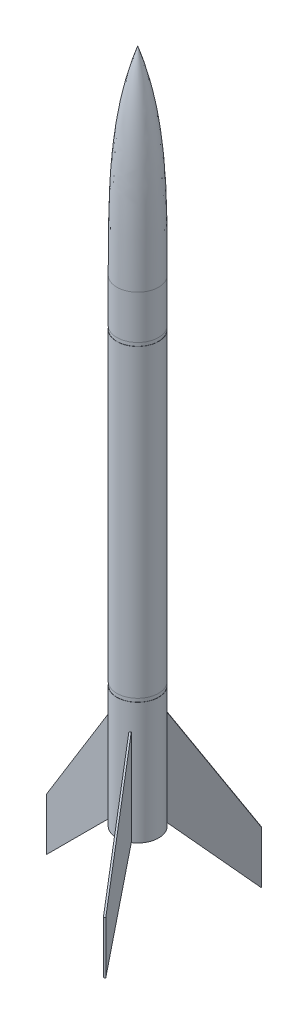
ISO-10303-21;
HEADER;
FILE_DESCRIPTION(('STEP AP214'),'2;1');
FILE_NAME('part.step','',(''),(''),'','','');
FILE_SCHEMA(('AUTOMOTIVE_DESIGN { 1 0 10303 214 1 1 1 1 }'));
ENDSEC;
DATA;
#1=APPLICATION_CONTEXT('core data for automotive mechanical design processes');
#2=APPLICATION_PROTOCOL_DEFINITION('international standard','automotive_design',2000,#1);
#3=PRODUCT_CONTEXT('',#1,'mechanical');
#4=PRODUCT('Part','Part','',(#3));
#5=PRODUCT_RELATED_PRODUCT_CATEGORY('part','',(#4));
#6=PRODUCT_DEFINITION_FORMATION('','',#4);
#7=PRODUCT_DEFINITION_CONTEXT('part definition',#1,'design');
#8=PRODUCT_DEFINITION('design','',#6,#7);
#9=PRODUCT_DEFINITION_SHAPE('','',#8);
#10=(LENGTH_UNIT() NAMED_UNIT(*) SI_UNIT(.MILLI.,.METRE.));
#11=(NAMED_UNIT(*) PLANE_ANGLE_UNIT() SI_UNIT($,.RADIAN.));
#12=(NAMED_UNIT(*) SI_UNIT($,.STERADIAN.) SOLID_ANGLE_UNIT());
#13=UNCERTAINTY_MEASURE_WITH_UNIT(LENGTH_MEASURE(1.E-05),#10,'distance_accuracy_value','');
#14=(GEOMETRIC_REPRESENTATION_CONTEXT(3) GLOBAL_UNCERTAINTY_ASSIGNED_CONTEXT((#13)) GLOBAL_UNIT_ASSIGNED_CONTEXT((#10,
#11,#12)) REPRESENTATION_CONTEXT('',''));
#15=CARTESIAN_POINT('',(0.,0.,0.));
#16=DIRECTION('',(0.,0.,1.));
#17=DIRECTION('',(1.,0.,0.));
#18=AXIS2_PLACEMENT_3D('',#15,#16,#17);
#19=CARTESIAN_POINT('',(0.,0.,0.));
#20=DIRECTION('',(0.,-1.,0.));
#21=DIRECTION('',(0.,0.,-1.));
#22=AXIS2_PLACEMENT_3D('',#19,#20,#21);
#23=CYLINDRICAL_SURFACE('',#22,12.);
#24=DIRECTION('',(0.,-1.,0.));
#25=VECTOR('',#24,1.);
#26=CARTESIAN_POINT('',(6.42780210603302,0.,10.1332798286476));
#27=LINE('',#26,#25);
#28=CARTESIAN_POINT('',(6.42780210603302,0.,10.1332798286476));
#29=VERTEX_POINT('',#28);
#30=CARTESIAN_POINT('',(6.42780210603302,55.,10.1332798286477));
#31=VERTEX_POINT('',#30);
#32=EDGE_CURVE('E11',#29,#31,#27,.F.);
#33=ORIENTED_EDGE('',*,*,#32,.F.);
#34=CARTESIAN_POINT('',(0.,0.,0.));
#35=DIRECTION('',(0.,-1.,0.));
#36=DIRECTION('',(0.,0.,-1.));
#37=AXIS2_PLACEMENT_3D('',#34,#35,#36);
#38=CIRCLE('',#37,12.);
#39=CARTESIAN_POINT('',(6.42780210603317,0.,-10.1332798286476));
#40=VERTEX_POINT('',#39);
#41=EDGE_CURVE('E357',#40,#29,#38,.T.);
#42=ORIENTED_EDGE('',*,*,#41,.F.);
#43=DIRECTION('',(0.,-1.,0.));
#44=VECTOR('',#43,1.);
#45=CARTESIAN_POINT('',(6.42780210603317,0.,-10.1332798286476));
#46=LINE('',#45,#44);
#47=CARTESIAN_POINT('',(6.42780210603317,55.,-10.1332798286476));
#48=VERTEX_POINT('',#47);
#49=EDGE_CURVE('E372',#40,#48,#46,.F.);
#50=ORIENTED_EDGE('',*,*,#49,.T.);
#51=CARTESIAN_POINT('',(0.,55.,0.));
#52=DIRECTION('',(0.,-1.,0.));
#53=DIRECTION('',(0.,0.,-1.));
#54=AXIS2_PLACEMENT_3D('',#51,#52,#53);
#55=CIRCLE('',#54,12.);
#56=CARTESIAN_POINT('',(6.00000000000005,55.,-10.3923048454132));
#57=VERTEX_POINT('',#56);
#58=EDGE_CURVE('E374',#48,#57,#55,.F.);
#59=ORIENTED_EDGE('',*,*,#58,.T.);
#60=CARTESIAN_POINT('',(5.56177670224873,55.,-10.6332798286476));
#61=VERTEX_POINT('',#60);
#62=EDGE_CURVE('E377',#57,#61,#55,.F.);
#63=ORIENTED_EDGE('',*,*,#62,.T.);
#64=DIRECTION('',(0.,-1.,0.));
#65=VECTOR('',#64,1.);
#66=CARTESIAN_POINT('',(5.56177670224873,0.,-10.6332798286476));
#67=LINE('',#66,#65);
#68=CARTESIAN_POINT('',(5.56177670224873,0.,-10.6332798286476));
#69=VERTEX_POINT('',#68);
#70=EDGE_CURVE('E378',#69,#61,#67,.F.);
#71=ORIENTED_EDGE('',*,*,#70,.F.);
#72=CARTESIAN_POINT('',(-11.9895788082818,0.,-0.5));
#73=VERTEX_POINT('',#72);
#74=EDGE_CURVE('E359',#73,#69,#38,.T.);
#75=ORIENTED_EDGE('',*,*,#74,.F.);
#76=DIRECTION('',(0.,-1.,0.));
#77=VECTOR('',#76,1.);
#78=CARTESIAN_POINT('',(-11.9895788082818,0.,-0.5));
#79=LINE('',#78,#77);
#80=CARTESIAN_POINT('',(-11.9895788082818,55.,-0.5));
#81=VERTEX_POINT('',#80);
#82=EDGE_CURVE('E362',#73,#81,#79,.F.);
#83=ORIENTED_EDGE('',*,*,#82,.T.);
#84=CARTESIAN_POINT('',(0.,55.,0.));
#85=DIRECTION('',(0.,-1.,0.));
#86=DIRECTION('',(0.,0.,-1.));
#87=AXIS2_PLACEMENT_3D('',#84,#85,#86);
#88=CIRCLE('',#87,12.);
#89=CARTESIAN_POINT('',(-12.,55.,0.));
#90=VERTEX_POINT('',#89);
#91=EDGE_CURVE('E366',#81,#90,#88,.F.);
#92=ORIENTED_EDGE('',*,*,#91,.T.);
#93=CARTESIAN_POINT('',(-11.9895788082818,55.,0.5));
#94=VERTEX_POINT('',#93);
#95=EDGE_CURVE('E369',#90,#94,#88,.F.);
#96=ORIENTED_EDGE('',*,*,#95,.T.);
#97=DIRECTION('',(0.,-1.,0.));
#98=VECTOR('',#97,1.);
#99=CARTESIAN_POINT('',(-11.9895788082818,0.,0.5));
#100=LINE('',#99,#98);
#101=CARTESIAN_POINT('',(-11.9895788082818,0.,0.5));
#102=VERTEX_POINT('',#101);
#103=EDGE_CURVE('E370',#102,#94,#100,.F.);
#104=ORIENTED_EDGE('',*,*,#103,.F.);
#105=CARTESIAN_POINT('',(5.56177670224858,0.,10.6332798286476));
#106=VERTEX_POINT('',#105);
#107=EDGE_CURVE('E360',#106,#102,#38,.T.);
#108=ORIENTED_EDGE('',*,*,#107,.F.);
#109=DIRECTION('',(0.,-1.,0.));
#110=VECTOR('',#109,1.);
#111=CARTESIAN_POINT('',(5.56177670224858,0.,10.6332798286476));
#112=LINE('',#111,#110);
#113=CARTESIAN_POINT('',(5.56177670224858,55.,10.6332798286476));
#114=VERTEX_POINT('',#113);
#115=EDGE_CURVE('E380',#106,#114,#112,.F.);
#116=ORIENTED_EDGE('',*,*,#115,.T.);
#117=CARTESIAN_POINT('',(0.,55.,0.));
#118=DIRECTION('',(0.,-1.,0.));
#119=DIRECTION('',(0.,0.,-1.));
#120=AXIS2_PLACEMENT_3D('',#117,#118,#119);
#121=CIRCLE('',#120,12.);
#122=CARTESIAN_POINT('',(5.9999999999999,55.,10.3923048454133));
#123=VERTEX_POINT('',#122);
#124=EDGE_CURVE('E382',#114,#123,#121,.F.);
#125=ORIENTED_EDGE('',*,*,#124,.T.);
#126=EDGE_CURVE('E50',#123,#31,#121,.F.);
#127=ORIENTED_EDGE('',*,*,#126,.T.);
#128=EDGE_LOOP('',(#33,#42,#50,#59,#63,#71,#75,#83,#92,#96,#104,#108,#116,#125,#127));
#129=FACE_BOUND('',#128,.T.);
#130=CARTESIAN_POINT('',(0.,70.,0.));
#131=DIRECTION('',(0.,1.,0.));
#132=DIRECTION('',(0.,0.,1.));
#133=AXIS2_PLACEMENT_3D('',#130,#131,#132);
#134=CIRCLE('',#133,12.);
#135=CARTESIAN_POINT('',(0.,70.,12.));
#136=VERTEX_POINT('',#135);
#137=EDGE_CURVE('E214',#136,#136,#134,.T.);
#138=ORIENTED_EDGE('',*,*,#137,.F.);
#139=EDGE_LOOP('',(#138));
#140=FACE_BOUND('',#139,.T.);
#141=ADVANCED_FACE('F42',(#129,#140),#23,.T.);
#142=CARTESIAN_POINT('',(12.,0.,0.));
#143=DIRECTION('',(0.,-1.,0.));
#144=DIRECTION('',(0.,0.,-1.));
#145=AXIS2_PLACEMENT_3D('',#142,#143,#144);
#146=PLANE('',#145);
#147=ORIENTED_EDGE('',*,*,#41,.T.);
#148=DIRECTION('',(-0.499999999999992,0.,-0.866025403784443));
#149=VECTOR('',#148,1.);
#150=CARTESIAN_POINT('',(6.43301270189213,0.,10.1423048454133));
#151=LINE('',#150,#149);
#152=CARTESIAN_POINT('',(6.43301270189213,0.,10.1423048454133));
#153=VERTEX_POINT('',#152);
#154=EDGE_CURVE('E188',#153,#29,#151,.T.);
#155=ORIENTED_EDGE('',*,*,#154,.F.);
#156=DIRECTION('',(-0.866025403784443,0.,0.499999999999992));
#157=VECTOR('',#156,1.);
#158=CARTESIAN_POINT('',(6.43301270189213,0.,10.1423048454133));
#159=LINE('',#158,#157);
#160=CARTESIAN_POINT('',(5.56698729810768,0.,10.6423048454133));
#161=VERTEX_POINT('',#160);
#162=EDGE_CURVE('E210',#153,#161,#159,.T.);
#163=ORIENTED_EDGE('',*,*,#162,.T.);
#164=DIRECTION('',(-0.499999999999992,0.,-0.866025403784443));
#165=VECTOR('',#164,1.);
#166=CARTESIAN_POINT('',(5.56698729810768,0.,10.6423048454133));
#167=LINE('',#166,#165);
#168=EDGE_CURVE('E211',#161,#106,#167,.T.);
#169=ORIENTED_EDGE('',*,*,#168,.T.);
#170=ORIENTED_EDGE('',*,*,#107,.T.);
#171=DIRECTION('',(1.,0.,0.));
#172=VECTOR('',#171,1.);
#173=CARTESIAN_POINT('',(-12.,0.,0.5));
#174=LINE('',#173,#172);
#175=CARTESIAN_POINT('',(-12.,0.,0.5));
#176=VERTEX_POINT('',#175);
#177=EDGE_CURVE('E261',#176,#102,#174,.T.);
#178=ORIENTED_EDGE('',*,*,#177,.F.);
#179=DIRECTION('',(0.,0.,-1.));
#180=VECTOR('',#179,1.);
#181=CARTESIAN_POINT('',(-12.,0.,0.5));
#182=LINE('',#181,#180);
#183=CARTESIAN_POINT('',(-12.,0.,-0.5));
#184=VERTEX_POINT('',#183);
#185=EDGE_CURVE('E273',#176,#184,#182,.T.);
#186=ORIENTED_EDGE('',*,*,#185,.T.);
#187=DIRECTION('',(1.,0.,0.));
#188=VECTOR('',#187,1.);
#189=CARTESIAN_POINT('',(-12.,0.,-0.5));
#190=LINE('',#189,#188);
#191=EDGE_CURVE('E260',#184,#73,#190,.T.);
#192=ORIENTED_EDGE('',*,*,#191,.T.);
#193=ORIENTED_EDGE('',*,*,#74,.T.);
#194=DIRECTION('',(-0.500000000000004,0.,0.866025403784436));
#195=VECTOR('',#194,1.);
#196=CARTESIAN_POINT('',(5.56698729810783,0.,-10.6423048454132));
#197=LINE('',#196,#195);
#198=CARTESIAN_POINT('',(5.56698729810783,0.,-10.6423048454132));
#199=VERTEX_POINT('',#198);
#200=EDGE_CURVE('E228',#199,#69,#197,.T.);
#201=ORIENTED_EDGE('',*,*,#200,.F.);
#202=DIRECTION('',(0.866025403784436,0.,0.500000000000004));
#203=VECTOR('',#202,1.);
#204=CARTESIAN_POINT('',(5.56698729810783,0.,-10.6423048454132));
#205=LINE('',#204,#203);
#206=CARTESIAN_POINT('',(6.43301270189227,0.,-10.1423048454132));
#207=VERTEX_POINT('',#206);
#208=EDGE_CURVE('E239',#199,#207,#205,.T.);
#209=ORIENTED_EDGE('',*,*,#208,.T.);
#210=DIRECTION('',(-0.500000000000004,0.,0.866025403784436));
#211=VECTOR('',#210,1.);
#212=CARTESIAN_POINT('',(6.43301270189227,0.,-10.1423048454132));
#213=LINE('',#212,#211);
#214=EDGE_CURVE('E196',#207,#40,#213,.T.);
#215=ORIENTED_EDGE('',*,*,#214,.T.);
#216=EDGE_LOOP('',(#147,#155,#163,#169,#170,#178,#186,#192,#193,#201,#209,#215));
#217=FACE_BOUND('',#216,.T.);
#218=ADVANCED_FACE('F44',(#217),#146,.T.);
#219=CARTESIAN_POINT('',(-9.,55.,0.5));
#220=DIRECTION('',(0.,-1.,0.));
#221=DIRECTION('',(0.,0.,-1.));
#222=AXIS2_PLACEMENT_3D('',#219,#220,#221);
#223=PLANE('',#222);
#224=ORIENTED_EDGE('',*,*,#91,.F.);
#225=DIRECTION('',(-1.,0.,0.));
#226=VECTOR('',#225,1.);
#227=CARTESIAN_POINT('',(-9.,55.,-0.5));
#228=LINE('',#227,#226);
#229=CARTESIAN_POINT('',(-12.,55.,-0.5));
#230=VERTEX_POINT('',#229);
#231=EDGE_CURVE('E276',#81,#230,#228,.T.);
#232=ORIENTED_EDGE('',*,*,#231,.T.);
#233=DIRECTION('',(0.,0.,-1.));
#234=VECTOR('',#233,1.);
#235=CARTESIAN_POINT('',(-12.,55.,0.5));
#236=LINE('',#235,#234);
#237=EDGE_CURVE('E292',#90,#230,#236,.T.);
#238=ORIENTED_EDGE('',*,*,#237,.F.);
#239=EDGE_LOOP('',(#224,#232,#238));
#240=FACE_BOUND('',#239,.T.);
#241=ADVANCED_FACE('F320',(#240),#223,.F.);
#242=ORIENTED_EDGE('',*,*,#95,.F.);
#243=CARTESIAN_POINT('',(-12.,55.,0.5));
#244=VERTEX_POINT('',#243);
#245=EDGE_CURVE('E293',#244,#90,#236,.T.);
#246=ORIENTED_EDGE('',*,*,#245,.F.);
#247=DIRECTION('',(-1.,0.,0.));
#248=VECTOR('',#247,1.);
#249=CARTESIAN_POINT('',(-9.,55.,0.5));
#250=LINE('',#249,#248);
#251=EDGE_CURVE('E264',#94,#244,#250,.T.);
#252=ORIENTED_EDGE('',*,*,#251,.F.);
#253=EDGE_LOOP('',(#242,#246,#252));
#254=FACE_BOUND('',#253,.T.);
#255=ADVANCED_FACE('F312',(#254),#223,.F.);
#256=CARTESIAN_POINT('',(-52.,-10.,0.5));
#257=DIRECTION('',(0.851658316704544,-0.524097425664335,0.));
#258=DIRECTION('',(0.524097425664335,0.851658316704544,0.));
#259=AXIS2_PLACEMENT_3D('',#256,#257,#258);
#260=PLANE('',#259);
#261=DIRECTION('',(-0.524097425664335,-0.851658316704544,0.));
#262=VECTOR('',#261,1.);
#263=CARTESIAN_POINT('',(-52.,-10.,-0.5));
#264=LINE('',#263,#262);
#265=CARTESIAN_POINT('',(-52.,-10.,-0.5));
#266=VERTEX_POINT('',#265);
#267=EDGE_CURVE('E279',#230,#266,#264,.T.);
#268=ORIENTED_EDGE('',*,*,#267,.T.);
#269=DIRECTION('',(0.,0.,-1.));
#270=VECTOR('',#269,1.);
#271=CARTESIAN_POINT('',(-52.,-10.,0.5));
#272=LINE('',#271,#270);
#273=CARTESIAN_POINT('',(-52.,-10.,0.5));
#274=VERTEX_POINT('',#273);
#275=EDGE_CURVE('E289',#274,#266,#272,.T.);
#276=ORIENTED_EDGE('',*,*,#275,.F.);
#277=DIRECTION('',(-0.524097425664335,-0.851658316704544,0.));
#278=VECTOR('',#277,1.);
#279=CARTESIAN_POINT('',(-52.,-10.,0.5));
#280=LINE('',#279,#278);
#281=EDGE_CURVE('E267',#244,#274,#280,.T.);
#282=ORIENTED_EDGE('',*,*,#281,.F.);
#283=ORIENTED_EDGE('',*,*,#245,.T.);
#284=ORIENTED_EDGE('',*,*,#237,.T.);
#285=EDGE_LOOP('',(#268,#276,#282,#283,#284));
#286=FACE_BOUND('',#285,.T.);
#287=ADVANCED_FACE('F407',(#286),#260,.F.);
#288=CARTESIAN_POINT('',(-52.,-40.,0.5));
#289=DIRECTION('',(1.,0.,0.));
#290=DIRECTION('',(0.,0.,-1.));
#291=AXIS2_PLACEMENT_3D('',#288,#289,#290);
#292=PLANE('',#291);
#293=DIRECTION('',(0.,-1.,0.));
#294=VECTOR('',#293,1.);
#295=CARTESIAN_POINT('',(-52.,-40.,-0.5));
#296=LINE('',#295,#294);
#297=CARTESIAN_POINT('',(-52.,-40.,-0.5));
#298=VERTEX_POINT('',#297);
#299=EDGE_CURVE('E281',#266,#298,#296,.T.);
#300=ORIENTED_EDGE('',*,*,#299,.T.);
#301=DIRECTION('',(0.,0.,-1.));
#302=VECTOR('',#301,1.);
#303=CARTESIAN_POINT('',(-52.,-40.,0.5));
#304=LINE('',#303,#302);
#305=CARTESIAN_POINT('',(-52.,-40.,0.5));
#306=VERTEX_POINT('',#305);
#307=EDGE_CURVE('E286',#306,#298,#304,.T.);
#308=ORIENTED_EDGE('',*,*,#307,.F.);
#309=DIRECTION('',(0.,-1.,0.));
#310=VECTOR('',#309,1.);
#311=CARTESIAN_POINT('',(-52.,-40.,0.5));
#312=LINE('',#311,#310);
#313=EDGE_CURVE('E269',#274,#306,#312,.T.);
#314=ORIENTED_EDGE('',*,*,#313,.F.);
#315=ORIENTED_EDGE('',*,*,#275,.T.);
#316=EDGE_LOOP('',(#300,#308,#314,#315));
#317=FACE_BOUND('',#316,.T.);
#318=ADVANCED_FACE('F413',(#317),#292,.F.);
#319=CARTESIAN_POINT('',(-12.,0.,0.5));
#320=DIRECTION('',(-0.707106781186548,0.707106781186547,0.));
#321=DIRECTION('',(-0.707106781186547,-0.707106781186548,0.));
#322=AXIS2_PLACEMENT_3D('',#319,#320,#321);
#323=PLANE('',#322);
#324=DIRECTION('',(0.707106781186547,0.707106781186548,0.));
#325=VECTOR('',#324,1.);
#326=CARTESIAN_POINT('',(-12.,0.,-0.5));
#327=LINE('',#326,#325);
#328=EDGE_CURVE('E265',#298,#184,#327,.T.);
#329=ORIENTED_EDGE('',*,*,#328,.T.);
#330=ORIENTED_EDGE('',*,*,#185,.F.);
#331=DIRECTION('',(0.707106781186547,0.707106781186548,0.));
#332=VECTOR('',#331,1.);
#333=CARTESIAN_POINT('',(-12.,0.,0.5));
#334=LINE('',#333,#332);
#335=EDGE_CURVE('E271',#306,#176,#334,.T.);
#336=ORIENTED_EDGE('',*,*,#335,.F.);
#337=ORIENTED_EDGE('',*,*,#307,.T.);
#338=EDGE_LOOP('',(#329,#330,#336,#337));
#339=FACE_BOUND('',#338,.T.);
#340=ADVANCED_FACE('F417',(#339),#323,.F.);
#341=CARTESIAN_POINT('',(0.,0.,0.5));
#342=DIRECTION('',(0.,0.,1.));
#343=DIRECTION('',(1.,0.,0.));
#344=AXIS2_PLACEMENT_3D('',#341,#342,#343);
#345=PLANE('',#344);
#346=ORIENTED_EDGE('',*,*,#177,.T.);
#347=ORIENTED_EDGE('',*,*,#103,.T.);
#348=ORIENTED_EDGE('',*,*,#251,.T.);
#349=ORIENTED_EDGE('',*,*,#281,.T.);
#350=ORIENTED_EDGE('',*,*,#313,.T.);
#351=ORIENTED_EDGE('',*,*,#335,.T.);
#352=EDGE_LOOP('',(#346,#347,#348,#349,#350,#351));
#353=FACE_BOUND('',#352,.T.);
#354=ADVANCED_FACE('F400',(#353),#345,.T.);
#355=CARTESIAN_POINT('',(0.,0.,-0.5));
#356=DIRECTION('',(0.,0.,1.));
#357=DIRECTION('',(1.,0.,0.));
#358=AXIS2_PLACEMENT_3D('',#355,#356,#357);
#359=PLANE('',#358);
#360=ORIENTED_EDGE('',*,*,#82,.F.);
#361=ORIENTED_EDGE('',*,*,#191,.F.);
#362=ORIENTED_EDGE('',*,*,#328,.F.);
#363=ORIENTED_EDGE('',*,*,#299,.F.);
#364=ORIENTED_EDGE('',*,*,#267,.F.);
#365=ORIENTED_EDGE('',*,*,#231,.F.);
#366=EDGE_LOOP('',(#360,#361,#362,#363,#364,#365));
#367=FACE_BOUND('',#366,.T.);
#368=ADVANCED_FACE('F449',(#367),#359,.F.);
#369=CARTESIAN_POINT('',(4.06698729810782,55.,-8.04422863405993));
#370=DIRECTION('',(0.,-1.,0.));
#371=DIRECTION('',(0.,0.,-1.));
#372=AXIS2_PLACEMENT_3D('',#369,#370,#371);
#373=PLANE('',#372);
#374=ORIENTED_EDGE('',*,*,#58,.F.);
#375=DIRECTION('',(0.500000000000004,0.,-0.866025403784436));
#376=VECTOR('',#375,1.);
#377=CARTESIAN_POINT('',(4.93301270189226,55.,-7.54422863405993));
#378=LINE('',#377,#376);
#379=CARTESIAN_POINT('',(6.43301270189227,55.,-10.1423048454132));
#380=VERTEX_POINT('',#379);
#381=EDGE_CURVE('E65',#48,#380,#378,.T.);
#382=ORIENTED_EDGE('',*,*,#381,.T.);
#383=DIRECTION('',(0.866025403784436,0.,0.500000000000004));
#384=VECTOR('',#383,1.);
#385=CARTESIAN_POINT('',(5.56698729810783,55.,-10.6423048454132));
#386=LINE('',#385,#384);
#387=EDGE_CURVE('E256',#57,#380,#386,.T.);
#388=ORIENTED_EDGE('',*,*,#387,.F.);
#389=EDGE_LOOP('',(#374,#382,#388));
#390=FACE_BOUND('',#389,.T.);
#391=ADVANCED_FACE('F447',(#390),#373,.F.);
#392=ORIENTED_EDGE('',*,*,#62,.F.);
#393=CARTESIAN_POINT('',(5.56698729810783,55.,-10.6423048454132));
#394=VERTEX_POINT('',#393);
#395=EDGE_CURVE('E257',#394,#57,#386,.T.);
#396=ORIENTED_EDGE('',*,*,#395,.F.);
#397=DIRECTION('',(0.500000000000004,0.,-0.866025403784436));
#398=VECTOR('',#397,1.);
#399=CARTESIAN_POINT('',(4.06698729810782,55.,-8.04422863405993));
#400=LINE('',#399,#398);
#401=EDGE_CURVE('E230',#61,#394,#400,.T.);
#402=ORIENTED_EDGE('',*,*,#401,.F.);
#403=EDGE_LOOP('',(#392,#396,#402));
#404=FACE_BOUND('',#403,.T.);
#405=ADVANCED_FACE('F429',(#404),#373,.F.);
#406=CARTESIAN_POINT('',(25.566987298108,-10.,-45.2833209967907));
#407=DIRECTION('',(-0.425829158352275,-0.524097425664335,0.737557737610426));
#408=DIRECTION('',(0.,-0.815157841576796,-0.579238891404798));
#409=AXIS2_PLACEMENT_3D('',#406,#407,#408);
#410=PLANE('',#409);
#411=DIRECTION('',(0.262048712832169,-0.851658316704544,-0.453881684683339));
#412=VECTOR('',#411,1.);
#413=CARTESIAN_POINT('',(26.4330127018924,-10.,-44.7833209967907));
#414=LINE('',#413,#412);
#415=CARTESIAN_POINT('',(26.4330127018924,-10.,-44.7833209967907));
#416=VERTEX_POINT('',#415);
#417=EDGE_CURVE('E243',#380,#416,#414,.T.);
#418=ORIENTED_EDGE('',*,*,#417,.T.);
#419=DIRECTION('',(0.866025403784436,0.,0.500000000000004));
#420=VECTOR('',#419,1.);
#421=CARTESIAN_POINT('',(25.566987298108,-10.,-45.2833209967907));
#422=LINE('',#421,#420);
#423=CARTESIAN_POINT('',(25.566987298108,-10.,-45.2833209967907));
#424=VERTEX_POINT('',#423);
#425=EDGE_CURVE('E253',#424,#416,#422,.T.);
#426=ORIENTED_EDGE('',*,*,#425,.F.);
#427=DIRECTION('',(0.262048712832169,-0.851658316704544,-0.453881684683339));
#428=VECTOR('',#427,1.);
#429=CARTESIAN_POINT('',(25.566987298108,-10.,-45.2833209967907));
#430=LINE('',#429,#428);
#431=EDGE_CURVE('E233',#394,#424,#430,.T.);
#432=ORIENTED_EDGE('',*,*,#431,.F.);
#433=ORIENTED_EDGE('',*,*,#395,.T.);
#434=ORIENTED_EDGE('',*,*,#387,.T.);
#435=EDGE_LOOP('',(#418,#426,#432,#433,#434));
#436=FACE_BOUND('',#435,.T.);
#437=ADVANCED_FACE('F434',(#436),#410,.F.);
#438=CARTESIAN_POINT('',(25.566987298108,-40.,-45.2833209967907));
#439=DIRECTION('',(-0.500000000000004,0.,0.866025403784436));
#440=DIRECTION('',(0.866025403784436,0.,0.500000000000004));
#441=AXIS2_PLACEMENT_3D('',#438,#439,#440);
#442=PLANE('',#441);
#443=DIRECTION('',(0.,-1.,0.));
#444=VECTOR('',#443,1.);
#445=CARTESIAN_POINT('',(26.4330127018924,-40.,-44.7833209967907));
#446=LINE('',#445,#444);
#447=CARTESIAN_POINT('',(26.4330127018924,-40.,-44.7833209967907));
#448=VERTEX_POINT('',#447);
#449=EDGE_CURVE('E245',#416,#448,#446,.T.);
#450=ORIENTED_EDGE('',*,*,#449,.T.);
#451=DIRECTION('',(0.866025403784436,0.,0.500000000000004));
#452=VECTOR('',#451,1.);
#453=CARTESIAN_POINT('',(25.566987298108,-40.,-45.2833209967907));
#454=LINE('',#453,#452);
#455=CARTESIAN_POINT('',(25.566987298108,-40.,-45.2833209967907));
#456=VERTEX_POINT('',#455);
#457=EDGE_CURVE('E250',#456,#448,#454,.T.);
#458=ORIENTED_EDGE('',*,*,#457,.F.);
#459=DIRECTION('',(0.,-1.,0.));
#460=VECTOR('',#459,1.);
#461=CARTESIAN_POINT('',(25.566987298108,-40.,-45.2833209967907));
#462=LINE('',#461,#460);
#463=EDGE_CURVE('E235',#424,#456,#462,.T.);
#464=ORIENTED_EDGE('',*,*,#463,.F.);
#465=ORIENTED_EDGE('',*,*,#425,.T.);
#466=EDGE_LOOP('',(#450,#458,#464,#465));
#467=FACE_BOUND('',#466,.T.);
#468=ADVANCED_FACE('F440',(#467),#442,.F.);
#469=CARTESIAN_POINT('',(5.56698729810783,0.,-10.6423048454132));
#470=DIRECTION('',(0.353553390593277,0.707106781186547,-0.612372435695793));
#471=DIRECTION('',(0.,0.654653670707976,0.755928946018455));
#472=AXIS2_PLACEMENT_3D('',#469,#470,#471);
#473=PLANE('',#472);
#474=DIRECTION('',(-0.353553390593277,0.707106781186548,0.612372435695793));
#475=VECTOR('',#474,1.);
#476=CARTESIAN_POINT('',(6.43301270189227,0.,-10.1423048454132));
#477=LINE('',#476,#475);
#478=EDGE_CURVE('E231',#448,#207,#477,.T.);
#479=ORIENTED_EDGE('',*,*,#478,.T.);
#480=ORIENTED_EDGE('',*,*,#208,.F.);
#481=DIRECTION('',(-0.353553390593277,0.707106781186548,0.612372435695793));
#482=VECTOR('',#481,1.);
#483=CARTESIAN_POINT('',(5.56698729810783,0.,-10.6423048454132));
#484=LINE('',#483,#482);
#485=EDGE_CURVE('E237',#456,#199,#484,.T.);
#486=ORIENTED_EDGE('',*,*,#485,.F.);
#487=ORIENTED_EDGE('',*,*,#457,.T.);
#488=EDGE_LOOP('',(#479,#480,#486,#487));
#489=FACE_BOUND('',#488,.T.);
#490=ADVANCED_FACE('F444',(#489),#473,.F.);
#491=CARTESIAN_POINT('',(-0.433012701892218,0.,-0.250000000000002));
#492=DIRECTION('',(-0.866025403784436,0.,-0.500000000000004));
#493=DIRECTION('',(-0.500000000000004,0.,0.866025403784436));
#494=AXIS2_PLACEMENT_3D('',#491,#492,#493);
#495=PLANE('',#494);
#496=ORIENTED_EDGE('',*,*,#200,.T.);
#497=ORIENTED_EDGE('',*,*,#70,.T.);
#498=ORIENTED_EDGE('',*,*,#401,.T.);
#499=ORIENTED_EDGE('',*,*,#431,.T.);
#500=ORIENTED_EDGE('',*,*,#463,.T.);
#501=ORIENTED_EDGE('',*,*,#485,.T.);
#502=EDGE_LOOP('',(#496,#497,#498,#499,#500,#501));
#503=FACE_BOUND('',#502,.T.);
#504=ADVANCED_FACE('F426',(#503),#495,.T.);
#505=CARTESIAN_POINT('',(0.433012701892218,0.,0.250000000000002));
#506=DIRECTION('',(-0.866025403784436,0.,-0.500000000000004));
#507=DIRECTION('',(-0.500000000000004,0.,0.866025403784436));
#508=AXIS2_PLACEMENT_3D('',#505,#506,#507);
#509=PLANE('',#508);
#510=ORIENTED_EDGE('',*,*,#49,.F.);
#511=ORIENTED_EDGE('',*,*,#214,.F.);
#512=ORIENTED_EDGE('',*,*,#478,.F.);
#513=ORIENTED_EDGE('',*,*,#449,.F.);
#514=ORIENTED_EDGE('',*,*,#417,.F.);
#515=ORIENTED_EDGE('',*,*,#381,.F.);
#516=EDGE_LOOP('',(#510,#511,#512,#513,#514,#515));
#517=FACE_BOUND('',#516,.T.);
#518=ADVANCED_FACE('F445',(#517),#509,.F.);
#519=CARTESIAN_POINT('',(4.93301270189215,55.,7.54422863406));
#520=DIRECTION('',(0.,-1.,0.));
#521=DIRECTION('',(0.,0.,-1.));
#522=AXIS2_PLACEMENT_3D('',#519,#520,#521);
#523=PLANE('',#522);
#524=ORIENTED_EDGE('',*,*,#124,.F.);
#525=DIRECTION('',(0.499999999999992,0.,0.866025403784443));
#526=VECTOR('',#525,1.);
#527=CARTESIAN_POINT('',(4.06698729810771,55.,8.04422863405999));
#528=LINE('',#527,#526);
#529=CARTESIAN_POINT('',(5.56698729810768,55.,10.6423048454133));
#530=VERTEX_POINT('',#529);
#531=EDGE_CURVE('E57',#114,#530,#528,.T.);
#532=ORIENTED_EDGE('',*,*,#531,.T.);
#533=DIRECTION('',(-0.866025403784443,0.,0.499999999999992));
#534=VECTOR('',#533,1.);
#535=CARTESIAN_POINT('',(6.43301270189213,55.,10.1423048454133));
#536=LINE('',#535,#534);
#537=EDGE_CURVE('E197',#123,#530,#536,.T.);
#538=ORIENTED_EDGE('',*,*,#537,.F.);
#539=EDGE_LOOP('',(#524,#532,#538));
#540=FACE_BOUND('',#539,.T.);
#541=ADVANCED_FACE('F385',(#540),#523,.F.);
#542=ORIENTED_EDGE('',*,*,#126,.F.);
#543=CARTESIAN_POINT('',(6.43301270189213,55.,10.1423048454133));
#544=VERTEX_POINT('',#543);
#545=EDGE_CURVE('E191',#544,#123,#536,.T.);
#546=ORIENTED_EDGE('',*,*,#545,.F.);
#547=DIRECTION('',(0.499999999999992,0.,0.866025403784443));
#548=VECTOR('',#547,1.);
#549=CARTESIAN_POINT('',(4.93301270189215,55.,7.54422863406));
#550=LINE('',#549,#548);
#551=EDGE_CURVE('E179',#31,#544,#550,.T.);
#552=ORIENTED_EDGE('',*,*,#551,.F.);
#553=EDGE_LOOP('',(#542,#546,#552));
#554=FACE_BOUND('',#553,.T.);
#555=ADVANCED_FACE('F192',(#554),#523,.F.);
#556=CARTESIAN_POINT('',(26.4330127018918,-10.,44.783320996791));
#557=DIRECTION('',(-0.425829158352265,-0.524097425664335,-0.737557737610432));
#558=DIRECTION('',(0.,0.815157841576798,-0.579238891404795));
#559=AXIS2_PLACEMENT_3D('',#556,#557,#558);
#560=PLANE('',#559);
#561=DIRECTION('',(0.262048712832163,-0.851658316704544,0.453881684683343));
#562=VECTOR('',#561,1.);
#563=CARTESIAN_POINT('',(25.5669872981074,-10.,45.283320996791));
#564=LINE('',#563,#562);
#565=CARTESIAN_POINT('',(25.5669872981074,-10.,45.283320996791));
#566=VERTEX_POINT('',#565);
#567=EDGE_CURVE('E216',#530,#566,#564,.T.);
#568=ORIENTED_EDGE('',*,*,#567,.T.);
#569=DIRECTION('',(-0.866025403784443,0.,0.499999999999992));
#570=VECTOR('',#569,1.);
#571=CARTESIAN_POINT('',(26.4330127018918,-10.,44.783320996791));
#572=LINE('',#571,#570);
#573=CARTESIAN_POINT('',(26.4330127018918,-10.,44.783320996791));
#574=VERTEX_POINT('',#573);
#575=EDGE_CURVE('E201',#574,#566,#572,.T.);
#576=ORIENTED_EDGE('',*,*,#575,.F.);
#577=DIRECTION('',(0.262048712832163,-0.851658316704544,0.453881684683343));
#578=VECTOR('',#577,1.);
#579=CARTESIAN_POINT('',(26.4330127018918,-10.,44.783320996791));
#580=LINE('',#579,#578);
#581=EDGE_CURVE('E183',#544,#574,#580,.T.);
#582=ORIENTED_EDGE('',*,*,#581,.F.);
#583=ORIENTED_EDGE('',*,*,#545,.T.);
#584=ORIENTED_EDGE('',*,*,#537,.T.);
#585=EDGE_LOOP('',(#568,#576,#582,#583,#584));
#586=FACE_BOUND('',#585,.T.);
#587=ADVANCED_FACE('F199',(#586),#560,.F.);
#588=CARTESIAN_POINT('',(26.4330127018918,-40.,44.783320996791));
#589=DIRECTION('',(-0.499999999999992,0.,-0.866025403784443));
#590=DIRECTION('',(-0.866025403784443,0.,0.499999999999992));
#591=AXIS2_PLACEMENT_3D('',#588,#589,#590);
#592=PLANE('',#591);
#593=DIRECTION('',(0.,-1.,0.));
#594=VECTOR('',#593,1.);
#595=CARTESIAN_POINT('',(25.5669872981074,-40.,45.283320996791));
#596=LINE('',#595,#594);
#597=CARTESIAN_POINT('',(25.5669872981074,-40.,45.283320996791));
#598=VERTEX_POINT('',#597);
#599=EDGE_CURVE('E218',#566,#598,#596,.T.);
#600=ORIENTED_EDGE('',*,*,#599,.T.);
#601=DIRECTION('',(-0.866025403784443,0.,0.499999999999992));
#602=VECTOR('',#601,1.);
#603=CARTESIAN_POINT('',(26.4330127018918,-40.,44.783320996791));
#604=LINE('',#603,#602);
#605=CARTESIAN_POINT('',(26.4330127018918,-40.,44.783320996791));
#606=VERTEX_POINT('',#605);
#607=EDGE_CURVE('E224',#606,#598,#604,.T.);
#608=ORIENTED_EDGE('',*,*,#607,.F.);
#609=DIRECTION('',(0.,-1.,0.));
#610=VECTOR('',#609,1.);
#611=CARTESIAN_POINT('',(26.4330127018918,-40.,44.783320996791));
#612=LINE('',#611,#610);
#613=EDGE_CURVE('E203',#574,#606,#612,.T.);
#614=ORIENTED_EDGE('',*,*,#613,.F.);
#615=ORIENTED_EDGE('',*,*,#575,.T.);
#616=EDGE_LOOP('',(#600,#608,#614,#615));
#617=FACE_BOUND('',#616,.T.);
#618=ADVANCED_FACE('F388',(#617),#592,.F.);
#619=CARTESIAN_POINT('',(6.43301270189213,0.,10.1423048454133));
#620=DIRECTION('',(0.353553390593268,0.707106781186547,0.612372435695798));
#621=DIRECTION('',(0.,-0.654653670707979,0.755928946018453));
#622=AXIS2_PLACEMENT_3D('',#619,#620,#621);
#623=PLANE('',#622);
#624=DIRECTION('',(-0.353553390593268,0.707106781186548,-0.612372435695798));
#625=VECTOR('',#624,1.);
#626=CARTESIAN_POINT('',(5.56698729810768,0.,10.6423048454133));
#627=LINE('',#626,#625);
#628=EDGE_CURVE('E220',#598,#161,#627,.T.);
#629=ORIENTED_EDGE('',*,*,#628,.T.);
#630=ORIENTED_EDGE('',*,*,#162,.F.);
#631=DIRECTION('',(-0.353553390593268,0.707106781186548,-0.612372435695798));
#632=VECTOR('',#631,1.);
#633=CARTESIAN_POINT('',(6.43301270189213,0.,10.1423048454133));
#634=LINE('',#633,#632);
#635=EDGE_CURVE('E205',#606,#153,#634,.T.);
#636=ORIENTED_EDGE('',*,*,#635,.F.);
#637=ORIENTED_EDGE('',*,*,#607,.T.);
#638=EDGE_LOOP('',(#629,#630,#636,#637));
#639=FACE_BOUND('',#638,.T.);
#640=ADVANCED_FACE('F394',(#639),#623,.F.);
#641=CARTESIAN_POINT('',(0.433012701892222,0.,-0.249999999999996));
#642=DIRECTION('',(0.866025403784443,0.,-0.499999999999992));
#643=DIRECTION('',(-0.499999999999992,0.,-0.866025403784443));
#644=AXIS2_PLACEMENT_3D('',#641,#642,#643);
#645=PLANE('',#644);
#646=ORIENTED_EDGE('',*,*,#154,.T.);
#647=ORIENTED_EDGE('',*,*,#32,.T.);
#648=ORIENTED_EDGE('',*,*,#551,.T.);
#649=ORIENTED_EDGE('',*,*,#581,.T.);
#650=ORIENTED_EDGE('',*,*,#613,.T.);
#651=ORIENTED_EDGE('',*,*,#635,.T.);
#652=EDGE_LOOP('',(#646,#647,#648,#649,#650,#651));
#653=FACE_BOUND('',#652,.T.);
#654=ADVANCED_FACE('F181',(#653),#645,.T.);
#655=CARTESIAN_POINT('',(-0.433012701892222,0.,0.249999999999996));
#656=DIRECTION('',(0.866025403784443,0.,-0.499999999999992));
#657=DIRECTION('',(-0.499999999999992,0.,-0.866025403784443));
#658=AXIS2_PLACEMENT_3D('',#655,#656,#657);
#659=PLANE('',#658);
#660=ORIENTED_EDGE('',*,*,#115,.F.);
#661=ORIENTED_EDGE('',*,*,#168,.F.);
#662=ORIENTED_EDGE('',*,*,#628,.F.);
#663=ORIENTED_EDGE('',*,*,#599,.F.);
#664=ORIENTED_EDGE('',*,*,#567,.F.);
#665=ORIENTED_EDGE('',*,*,#531,.F.);
#666=EDGE_LOOP('',(#660,#661,#662,#663,#664,#665));
#667=FACE_BOUND('',#666,.T.);
#668=ADVANCED_FACE('F391',(#667),#659,.F.);
#669=CARTESIAN_POINT('',(12.,70.,0.));
#670=DIRECTION('',(0.,1.,0.));
#671=DIRECTION('',(0.,0.,1.));
#672=AXIS2_PLACEMENT_3D('',#669,#670,#671);
#673=PLANE('',#672);
#674=ORIENTED_EDGE('',*,*,#137,.T.);
#675=EDGE_LOOP('',(#674));
#676=FACE_BOUND('',#675,.T.);
#677=CARTESIAN_POINT('',(0.,70.,0.));
#678=DIRECTION('',(0.,1.,0.));
#679=DIRECTION('',(0.,0.,1.));
#680=AXIS2_PLACEMENT_3D('',#677,#678,#679);
#681=CIRCLE('',#680,11.9);
#682=CARTESIAN_POINT('',(0.,70.,11.9));
#683=VERTEX_POINT('',#682);
#684=EDGE_CURVE('E878',#683,#683,#681,.T.);
#685=ORIENTED_EDGE('',*,*,#684,.F.);
#686=EDGE_LOOP('',(#685));
#687=FACE_BOUND('',#686,.T.);
#688=ADVANCED_FACE('F591',(#676,#687),#673,.T.);
#689=CARTESIAN_POINT('',(0.,55.,0.));
#690=DIRECTION('',(0.,1.,0.));
#691=DIRECTION('',(0.,0.,1.));
#692=AXIS2_PLACEMENT_3D('',#689,#690,#691);
#693=CYLINDRICAL_SURFACE('',#692,11.9);
#694=ORIENTED_EDGE('',*,*,#684,.T.);
#695=EDGE_LOOP('',(#694));
#696=FACE_BOUND('',#695,.T.);
#697=CARTESIAN_POINT('',(0.,72.,0.));
#698=DIRECTION('',(0.,1.,0.));
#699=DIRECTION('',(0.,0.,1.));
#700=AXIS2_PLACEMENT_3D('',#697,#698,#699);
#701=CIRCLE('',#700,11.9);
#702=CARTESIAN_POINT('',(0.,72.,11.9));
#703=VERTEX_POINT('',#702);
#704=EDGE_CURVE('E879',#703,#703,#701,.T.);
#705=ORIENTED_EDGE('',*,*,#704,.F.);
#706=EDGE_LOOP('',(#705));
#707=FACE_BOUND('',#706,.T.);
#708=ADVANCED_FACE('F661',(#696,#707),#693,.T.);
#709=CARTESIAN_POINT('',(12.,72.,0.));
#710=DIRECTION('',(0.,-1.,0.));
#711=DIRECTION('',(0.,0.,-1.));
#712=AXIS2_PLACEMENT_3D('',#709,#710,#711);
#713=PLANE('',#712);
#714=ORIENTED_EDGE('',*,*,#704,.T.);
#715=EDGE_LOOP('',(#714));
#716=FACE_BOUND('',#715,.T.);
#717=CARTESIAN_POINT('',(0.,72.,0.));
#718=DIRECTION('',(0.,1.,0.));
#719=DIRECTION('',(0.,0.,1.));
#720=AXIS2_PLACEMENT_3D('',#717,#718,#719);
#721=CIRCLE('',#720,12.);
#722=CARTESIAN_POINT('',(0.,72.,12.));
#723=VERTEX_POINT('',#722);
#724=EDGE_CURVE('E350',#723,#723,#721,.T.);
#725=ORIENTED_EDGE('',*,*,#724,.F.);
#726=EDGE_LOOP('',(#725));
#727=FACE_BOUND('',#726,.T.);
#728=ADVANCED_FACE('F325',(#716,#727),#713,.T.);
#729=CARTESIAN_POINT('',(0.,247.,0.));
#730=DIRECTION('',(0.,1.,0.));
#731=DIRECTION('',(0.,0.,1.));
#732=AXIS2_PLACEMENT_3D('',#729,#730,#731);
#733=CIRCLE('',#732,12.);
#734=CARTESIAN_POINT('',(0.,247.,12.));
#735=VERTEX_POINT('',#734);
#736=EDGE_CURVE('E348',#735,#735,#733,.T.);
#737=ORIENTED_EDGE('',*,*,#736,.F.);
#738=EDGE_LOOP('',(#737));
#739=FACE_BOUND('',#738,.T.);
#740=ORIENTED_EDGE('',*,*,#724,.T.);
#741=EDGE_LOOP('',(#740));
#742=FACE_BOUND('',#741,.T.);
#743=ADVANCED_FACE('F316',(#739,#742),#23,.T.);
#744=CARTESIAN_POINT('',(12.,247.,0.));
#745=DIRECTION('',(0.,1.,0.));
#746=DIRECTION('',(0.,0.,1.));
#747=AXIS2_PLACEMENT_3D('',#744,#745,#746);
#748=PLANE('',#747);
#749=ORIENTED_EDGE('',*,*,#736,.T.);
#750=EDGE_LOOP('',(#749));
#751=FACE_BOUND('',#750,.T.);
#752=CARTESIAN_POINT('',(0.,247.,0.));
#753=DIRECTION('',(0.,1.,0.));
#754=DIRECTION('',(0.,0.,1.));
#755=AXIS2_PLACEMENT_3D('',#752,#753,#754);
#756=CIRCLE('',#755,11.9);
#757=CARTESIAN_POINT('',(0.,247.,11.9));
#758=VERTEX_POINT('',#757);
#759=EDGE_CURVE('E341',#758,#758,#756,.T.);
#760=ORIENTED_EDGE('',*,*,#759,.F.);
#761=EDGE_LOOP('',(#760));
#762=FACE_BOUND('',#761,.T.);
#763=ADVANCED_FACE('F324',(#751,#762),#748,.T.);
#764=CARTESIAN_POINT('',(0.,55.,0.));
#765=DIRECTION('',(0.,1.,0.));
#766=DIRECTION('',(0.,0.,1.));
#767=AXIS2_PLACEMENT_3D('',#764,#765,#766);
#768=CYLINDRICAL_SURFACE('',#767,11.9);
#769=ORIENTED_EDGE('',*,*,#759,.T.);
#770=EDGE_LOOP('',(#769));
#771=FACE_BOUND('',#770,.T.);
#772=CARTESIAN_POINT('',(0.,249.,0.));
#773=DIRECTION('',(0.,1.,0.));
#774=DIRECTION('',(0.,0.,1.));
#775=AXIS2_PLACEMENT_3D('',#772,#773,#774);
#776=CIRCLE('',#775,11.9);
#777=CARTESIAN_POINT('',(0.,249.,11.9));
#778=VERTEX_POINT('',#777);
#779=EDGE_CURVE('E338',#778,#778,#776,.T.);
#780=ORIENTED_EDGE('',*,*,#779,.F.);
#781=EDGE_LOOP('',(#780));
#782=FACE_BOUND('',#781,.T.);
#783=ADVANCED_FACE('F650',(#771,#782),#768,.T.);
#784=CARTESIAN_POINT('',(12.,249.,0.));
#785=DIRECTION('',(0.,-1.,0.));
#786=DIRECTION('',(0.,0.,-1.));
#787=AXIS2_PLACEMENT_3D('',#784,#785,#786);
#788=PLANE('',#787);
#789=ORIENTED_EDGE('',*,*,#779,.T.);
#790=EDGE_LOOP('',(#789));
#791=FACE_BOUND('',#790,.T.);
#792=CARTESIAN_POINT('',(0.,249.,0.));
#793=DIRECTION('',(0.,1.,0.));
#794=DIRECTION('',(0.,0.,1.));
#795=AXIS2_PLACEMENT_3D('',#792,#793,#794);
#796=CIRCLE('',#795,12.);
#797=CARTESIAN_POINT('',(0.,249.,12.));
#798=VERTEX_POINT('',#797);
#799=EDGE_CURVE('E336',#798,#798,#796,.T.);
#800=ORIENTED_EDGE('',*,*,#799,.F.);
#801=EDGE_LOOP('',(#800));
#802=FACE_BOUND('',#801,.T.);
#803=ADVANCED_FACE('F310',(#791,#802),#788,.T.);
#804=CARTESIAN_POINT('',(12.,274.,0.));
#805=CARTESIAN_POINT('',(12.,274.912097707523,0.));
#806=CARTESIAN_POINT('',(12.,313.539168353913,0.));
#807=CARTESIAN_POINT('',(12.0000000000006,353.463683824512,0.));
#808=CARTESIAN_POINT('',(0.,388.,0.));
#809=B_SPLINE_CURVE_WITH_KNOTS('',3,(#804,#805,#806,#807,#808),.UNSPECIFIED.,.F.,.F.,(4,1,4),
(0.,0.0236129142660676,1.),.UNSPECIFIED.);
#810=CARTESIAN_POINT('',(0.,0.,0.));
#811=DIRECTION('',(0.,-1.,0.));
#812=AXIS1_PLACEMENT('',#810,#811);
#813=SURFACE_OF_REVOLUTION('',#809,#812);
#814=CARTESIAN_POINT('',(0.,388.,0.));
#815=VERTEX_POINT('',#814);
#816=VERTEX_LOOP('',#815);
#817=FACE_BOUND('',#816,.T.);
#818=CARTESIAN_POINT('',(0.,274.,0.));
#819=DIRECTION('',(0.,-1.,0.));
#820=DIRECTION('',(0.,0.,-1.));
#821=AXIS2_PLACEMENT_3D('',#818,#819,#820);
#822=CIRCLE('',#821,12.);
#823=CARTESIAN_POINT('',(0.,274.,-12.));
#824=VERTEX_POINT('',#823);
#825=EDGE_CURVE('E296',#824,#824,#822,.T.);
#826=ORIENTED_EDGE('',*,*,#825,.F.);
#827=EDGE_LOOP('',(#826));
#828=FACE_BOUND('',#827,.T.);
#829=ADVANCED_FACE('F306',(#817,#828),#813,.F.);
#830=ORIENTED_EDGE('',*,*,#825,.T.);
#831=EDGE_LOOP('',(#830));
#832=FACE_BOUND('',#831,.T.);
#833=ORIENTED_EDGE('',*,*,#799,.T.);
#834=EDGE_LOOP('',(#833));
#835=FACE_BOUND('',#834,.T.);
#836=ADVANCED_FACE('F309',(#832,#835),#23,.T.);
#837=CLOSED_SHELL('',(#141,#218,#241,#255,#287,#318,#340,#354,#368,#391,#405,#437,#468,#490,
#504,#518,#541,#555,#587,#618,#640,#654,#668,#688,#708,#728,#743,#763,#783,#803,#829,#836));
#838=MANIFOLD_SOLID_BREP('B2',#837);
#839=ADVANCED_BREP_SHAPE_REPRESENTATION('',(#18,#838),#14);
#840=SHAPE_DEFINITION_REPRESENTATION(#9,#839);
ENDSEC;
END-ISO-10303-21;
